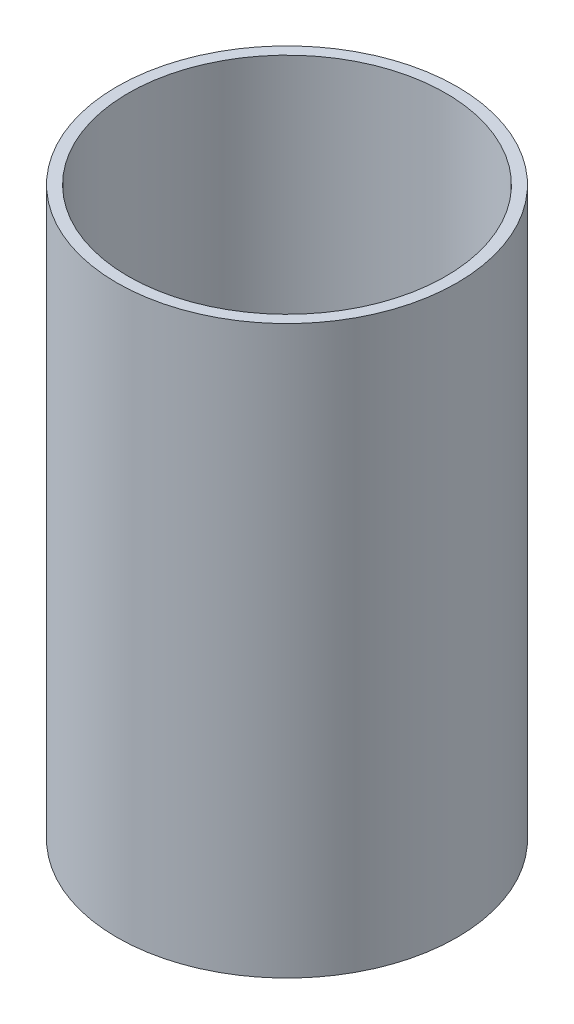
ISO-10303-21;
HEADER;
FILE_DESCRIPTION(('STEP AP214'),'2;1');
FILE_NAME('part.step','',(''),(''),'','','');
FILE_SCHEMA(('AUTOMOTIVE_DESIGN { 1 0 10303 214 1 1 1 1 }'));
ENDSEC;
DATA;
#1=APPLICATION_CONTEXT('core data for automotive mechanical design processes');
#2=APPLICATION_PROTOCOL_DEFINITION('international standard','automotive_design',2000,#1);
#3=PRODUCT_CONTEXT('',#1,'mechanical');
#4=PRODUCT('Part','Part','',(#3));
#5=PRODUCT_RELATED_PRODUCT_CATEGORY('part','',(#4));
#6=PRODUCT_DEFINITION_FORMATION('','',#4);
#7=PRODUCT_DEFINITION_CONTEXT('part definition',#1,'design');
#8=PRODUCT_DEFINITION('design','',#6,#7);
#9=PRODUCT_DEFINITION_SHAPE('','',#8);
#10=(LENGTH_UNIT() NAMED_UNIT(*) SI_UNIT(.MILLI.,.METRE.));
#11=(NAMED_UNIT(*) PLANE_ANGLE_UNIT() SI_UNIT($,.RADIAN.));
#12=(NAMED_UNIT(*) SI_UNIT($,.STERADIAN.) SOLID_ANGLE_UNIT());
#13=UNCERTAINTY_MEASURE_WITH_UNIT(LENGTH_MEASURE(1.E-05),#10,'distance_accuracy_value','');
#14=(GEOMETRIC_REPRESENTATION_CONTEXT(3) GLOBAL_UNCERTAINTY_ASSIGNED_CONTEXT((#13)) GLOBAL_UNIT_ASSIGNED_CONTEXT((#10,
#11,#12)) REPRESENTATION_CONTEXT('',''));
#15=CARTESIAN_POINT('',(0.,0.,0.));
#16=DIRECTION('',(0.,0.,1.));
#17=DIRECTION('',(1.,0.,0.));
#18=AXIS2_PLACEMENT_3D('',#15,#16,#17);
#19=CARTESIAN_POINT('',(0.,100.,0.));
#20=DIRECTION('',(0.,-1.,0.));
#21=DIRECTION('',(0.,0.,-1.));
#22=AXIS2_PLACEMENT_3D('',#19,#20,#21);
#23=CYLINDRICAL_SURFACE('',#22,30.);
#24=CARTESIAN_POINT('',(0.,100.,0.));
#25=DIRECTION('',(0.,1.,0.));
#26=DIRECTION('',(0.,0.,1.));
#27=AXIS2_PLACEMENT_3D('',#24,#25,#26);
#28=CIRCLE('',#27,30.);
#29=CARTESIAN_POINT('',(0.,100.,30.));
#30=VERTEX_POINT('',#29);
#31=EDGE_CURVE('E10',#30,#30,#28,.T.);
#32=ORIENTED_EDGE('',*,*,#31,.F.);
#33=EDGE_LOOP('',(#32));
#34=FACE_BOUND('',#33,.T.);
#35=CARTESIAN_POINT('',(0.,0.,0.));
#36=DIRECTION('',(0.,1.,0.));
#37=DIRECTION('',(0.,0.,1.));
#38=AXIS2_PLACEMENT_3D('',#35,#36,#37);
#39=CIRCLE('',#38,30.);
#40=CARTESIAN_POINT('',(0.,0.,30.));
#41=VERTEX_POINT('',#40);
#42=EDGE_CURVE('E33',#41,#41,#39,.T.);
#43=ORIENTED_EDGE('',*,*,#42,.T.);
#44=EDGE_LOOP('',(#43));
#45=FACE_BOUND('',#44,.T.);
#46=ADVANCED_FACE('F30',(#34,#45),#23,.T.);
#47=CARTESIAN_POINT('',(0.,100.,0.));
#48=DIRECTION('',(0.,1.,0.));
#49=DIRECTION('',(0.,0.,1.));
#50=AXIS2_PLACEMENT_3D('',#47,#48,#49);
#51=PLANE('',#50);
#52=CARTESIAN_POINT('',(0.,100.,0.));
#53=DIRECTION('',(0.,1.,0.));
#54=DIRECTION('',(0.,0.,1.));
#55=AXIS2_PLACEMENT_3D('',#52,#53,#54);
#56=CIRCLE('',#55,28.);
#57=CARTESIAN_POINT('',(0.,100.,28.));
#58=VERTEX_POINT('',#57);
#59=EDGE_CURVE('E40',#58,#58,#56,.T.);
#60=ORIENTED_EDGE('',*,*,#59,.F.);
#61=EDGE_LOOP('',(#60));
#62=FACE_BOUND('',#61,.T.);
#63=ORIENTED_EDGE('',*,*,#31,.T.);
#64=EDGE_LOOP('',(#63));
#65=FACE_BOUND('',#64,.T.);
#66=ADVANCED_FACE('F60',(#62,#65),#51,.T.);
#67=CARTESIAN_POINT('',(0.,0.,0.));
#68=DIRECTION('',(0.,1.,0.));
#69=DIRECTION('',(0.,0.,1.));
#70=AXIS2_PLACEMENT_3D('',#67,#68,#69);
#71=PLANE('',#70);
#72=ORIENTED_EDGE('',*,*,#42,.F.);
#73=EDGE_LOOP('',(#72));
#74=FACE_BOUND('',#73,.T.);
#75=ADVANCED_FACE('F52',(#74),#71,.F.);
#76=CARTESIAN_POINT('',(0.,100.,0.));
#77=DIRECTION('',(0.,-1.,0.));
#78=DIRECTION('',(0.,0.,-1.));
#79=AXIS2_PLACEMENT_3D('',#76,#77,#78);
#80=CYLINDRICAL_SURFACE('',#79,28.);
#81=ORIENTED_EDGE('',*,*,#59,.T.);
#82=EDGE_LOOP('',(#81));
#83=FACE_BOUND('',#82,.T.);
#84=CARTESIAN_POINT('',(0.,2.,0.));
#85=DIRECTION('',(0.,1.,0.));
#86=DIRECTION('',(0.,0.,1.));
#87=AXIS2_PLACEMENT_3D('',#84,#85,#86);
#88=CIRCLE('',#87,28.);
#89=CARTESIAN_POINT('',(0.,2.,28.));
#90=VERTEX_POINT('',#89);
#91=EDGE_CURVE('E44',#90,#90,#88,.T.);
#92=ORIENTED_EDGE('',*,*,#91,.F.);
#93=EDGE_LOOP('',(#92));
#94=FACE_BOUND('',#93,.T.);
#95=ADVANCED_FACE('F50',(#83,#94),#80,.F.);
#96=CARTESIAN_POINT('',(0.,2.,0.));
#97=DIRECTION('',(0.,1.,0.));
#98=DIRECTION('',(0.,0.,1.));
#99=AXIS2_PLACEMENT_3D('',#96,#97,#98);
#100=PLANE('',#99);
#101=ORIENTED_EDGE('',*,*,#91,.T.);
#102=EDGE_LOOP('',(#101));
#103=FACE_BOUND('',#102,.T.);
#104=ADVANCED_FACE('F48',(#103),#100,.T.);
#105=CLOSED_SHELL('',(#46,#66,#75,#95,#104));
#106=MANIFOLD_SOLID_BREP('B2',#105);
#107=ADVANCED_BREP_SHAPE_REPRESENTATION('',(#18,#106),#14);
#108=SHAPE_DEFINITION_REPRESENTATION(#9,#107);
ENDSEC;
END-ISO-10303-21;
